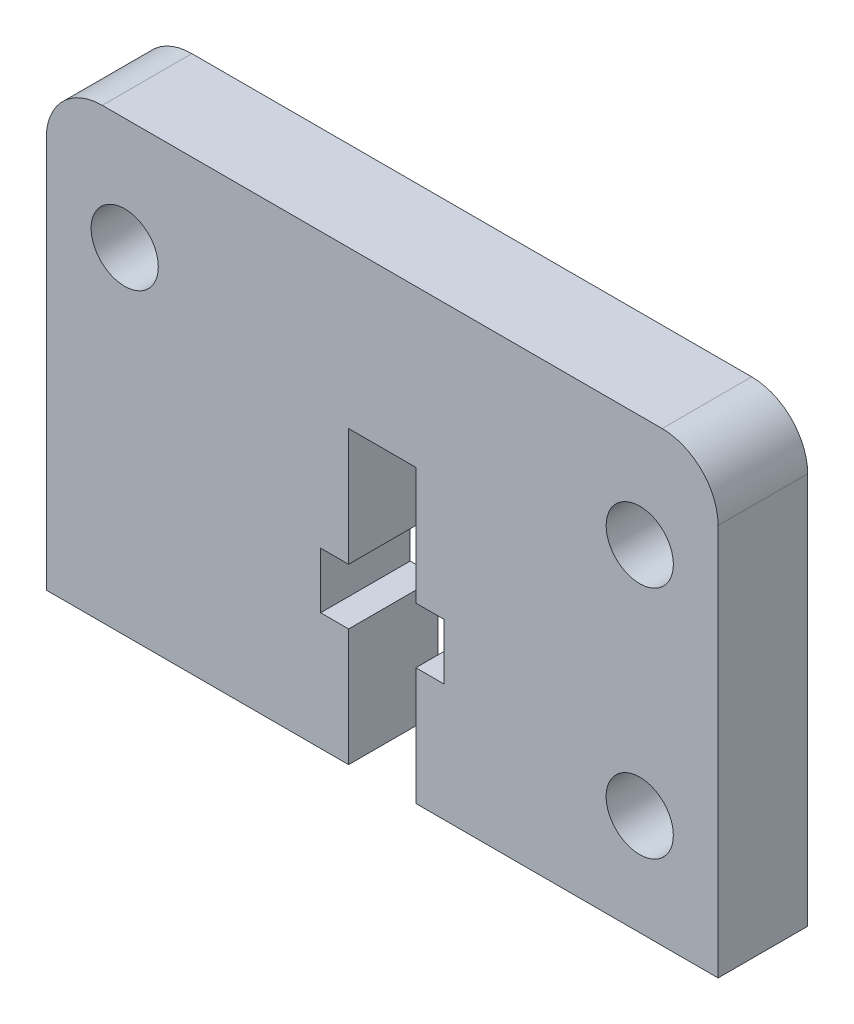
ISO-10303-21;
HEADER;
FILE_DESCRIPTION(('STEP AP214'),'2;1');
FILE_NAME('part.step','',(''),(''),'','','');
FILE_SCHEMA(('AUTOMOTIVE_DESIGN { 1 0 10303 214 1 1 1 1 }'));
ENDSEC;
DATA;
#1=APPLICATION_CONTEXT('core data for automotive mechanical design processes');
#2=APPLICATION_PROTOCOL_DEFINITION('international standard','automotive_design',2000,#1);
#3=PRODUCT_CONTEXT('',#1,'mechanical');
#4=PRODUCT('Part','Part','',(#3));
#5=PRODUCT_RELATED_PRODUCT_CATEGORY('part','',(#4));
#6=PRODUCT_DEFINITION_FORMATION('','',#4);
#7=PRODUCT_DEFINITION_CONTEXT('part definition',#1,'design');
#8=PRODUCT_DEFINITION('design','',#6,#7);
#9=PRODUCT_DEFINITION_SHAPE('','',#8);
#10=(LENGTH_UNIT() NAMED_UNIT(*) SI_UNIT(.MILLI.,.METRE.));
#11=(NAMED_UNIT(*) PLANE_ANGLE_UNIT() SI_UNIT($,.RADIAN.));
#12=(NAMED_UNIT(*) SI_UNIT($,.STERADIAN.) SOLID_ANGLE_UNIT());
#13=UNCERTAINTY_MEASURE_WITH_UNIT(LENGTH_MEASURE(1.E-05),#10,'distance_accuracy_value','');
#14=(GEOMETRIC_REPRESENTATION_CONTEXT(3) GLOBAL_UNCERTAINTY_ASSIGNED_CONTEXT((#13)) GLOBAL_UNIT_ASSIGNED_CONTEXT((#10,
#11,#12)) REPRESENTATION_CONTEXT('',''));
#15=CARTESIAN_POINT('',(0.,0.,0.));
#16=DIRECTION('',(0.,0.,1.));
#17=DIRECTION('',(1.,0.,0.));
#18=AXIS2_PLACEMENT_3D('',#15,#16,#17);
#19=CARTESIAN_POINT('',(0.,0.,4.));
#20=DIRECTION('',(0.,1.,0.));
#21=DIRECTION('',(0.,0.,1.));
#22=AXIS2_PLACEMENT_3D('',#19,#20,#21);
#23=PLANE('',#22);
#24=DIRECTION('',(0.,0.,-1.));
#25=VECTOR('',#24,1.);
#26=CARTESIAN_POINT('',(13.5,0.,49.3458928680426));
#27=LINE('',#26,#25);
#28=CARTESIAN_POINT('',(13.5,0.,4.));
#29=VERTEX_POINT('',#28);
#30=CARTESIAN_POINT('',(13.5,0.,0.));
#31=VERTEX_POINT('',#30);
#32=EDGE_CURVE('E188',#29,#31,#27,.T.);
#33=ORIENTED_EDGE('',*,*,#32,.F.);
#34=DIRECTION('',(1.,0.,0.));
#35=VECTOR('',#34,1.);
#36=CARTESIAN_POINT('',(0.,0.,4.));
#37=LINE('',#36,#35);
#38=CARTESIAN_POINT('',(0.,0.,4.));
#39=VERTEX_POINT('',#38);
#40=EDGE_CURVE('E241',#39,#29,#37,.T.);
#41=ORIENTED_EDGE('',*,*,#40,.F.);
#42=DIRECTION('',(0.,0.,-1.));
#43=VECTOR('',#42,1.);
#44=CARTESIAN_POINT('',(0.,0.,4.));
#45=LINE('',#44,#43);
#46=CARTESIAN_POINT('',(0.,0.,0.));
#47=VERTEX_POINT('',#46);
#48=EDGE_CURVE('E11',#39,#47,#45,.T.);
#49=ORIENTED_EDGE('',*,*,#48,.T.);
#50=DIRECTION('',(1.,0.,0.));
#51=VECTOR('',#50,1.);
#52=CARTESIAN_POINT('',(0.,0.,0.));
#53=LINE('',#52,#51);
#54=EDGE_CURVE('E256',#47,#31,#53,.T.);
#55=ORIENTED_EDGE('',*,*,#54,.T.);
#56=EDGE_LOOP('',(#33,#41,#49,#55));
#57=FACE_BOUND('',#56,.T.);
#58=ADVANCED_FACE('F36',(#57),#23,.F.);
#59=CARTESIAN_POINT('',(2.5,17.5,4.));
#60=DIRECTION('',(0.,0.,1.));
#61=DIRECTION('',(1.,0.,0.));
#62=AXIS2_PLACEMENT_3D('',#59,#60,#61);
#63=PLANE('',#62);
#64=DIRECTION('',(0.,1.,0.));
#65=VECTOR('',#64,1.);
#66=CARTESIAN_POINT('',(16.5,0.,4.));
#67=LINE('',#66,#65);
#68=CARTESIAN_POINT('',(16.5,0.,4.));
#69=VERTEX_POINT('',#68);
#70=CARTESIAN_POINT('',(16.5,5.25,4.));
#71=VERTEX_POINT('',#70);
#72=EDGE_CURVE('E214',#69,#71,#67,.T.);
#73=ORIENTED_EDGE('',*,*,#72,.F.);
#74=CARTESIAN_POINT('',(30.,0.,4.));
#75=VERTEX_POINT('',#74);
#76=EDGE_CURVE('E239',#69,#75,#37,.T.);
#77=ORIENTED_EDGE('',*,*,#76,.T.);
#78=DIRECTION('',(0.,1.,0.));
#79=VECTOR('',#78,1.);
#80=CARTESIAN_POINT('',(30.,0.,4.));
#81=LINE('',#80,#79);
#82=CARTESIAN_POINT('',(30.,17.5,4.));
#83=VERTEX_POINT('',#82);
#84=EDGE_CURVE('E244',#75,#83,#81,.T.);
#85=ORIENTED_EDGE('',*,*,#84,.T.);
#86=CARTESIAN_POINT('',(27.5,17.5,4.));
#87=DIRECTION('',(0.,0.,1.));
#88=DIRECTION('',(-1.,0.,0.));
#89=AXIS2_PLACEMENT_3D('',#86,#87,#88);
#90=CIRCLE('',#89,2.5);
#91=CARTESIAN_POINT('',(27.5,20.,4.));
#92=VERTEX_POINT('',#91);
#93=EDGE_CURVE('E246',#83,#92,#90,.T.);
#94=ORIENTED_EDGE('',*,*,#93,.T.);
#95=DIRECTION('',(-1.,0.,0.));
#96=VECTOR('',#95,1.);
#97=CARTESIAN_POINT('',(2.50000000000002,20.,4.));
#98=LINE('',#97,#96);
#99=CARTESIAN_POINT('',(2.50000000000002,20.,4.));
#100=VERTEX_POINT('',#99);
#101=EDGE_CURVE('E248',#92,#100,#98,.T.);
#102=ORIENTED_EDGE('',*,*,#101,.T.);
#103=CARTESIAN_POINT('',(2.5,17.5,4.));
#104=DIRECTION('',(0.,0.,1.));
#105=DIRECTION('',(1.,0.,0.));
#106=AXIS2_PLACEMENT_3D('',#103,#104,#105);
#107=CIRCLE('',#106,2.5);
#108=CARTESIAN_POINT('',(0.,17.5,4.));
#109=VERTEX_POINT('',#108);
#110=EDGE_CURVE('E250',#100,#109,#107,.T.);
#111=ORIENTED_EDGE('',*,*,#110,.T.);
#112=DIRECTION('',(0.,-1.,0.));
#113=VECTOR('',#112,1.);
#114=CARTESIAN_POINT('',(0.,0.,4.));
#115=LINE('',#114,#113);
#116=EDGE_CURVE('E236',#109,#39,#115,.T.);
#117=ORIENTED_EDGE('',*,*,#116,.T.);
#118=ORIENTED_EDGE('',*,*,#40,.T.);
#119=DIRECTION('',(0.,-1.,0.));
#120=VECTOR('',#119,1.);
#121=CARTESIAN_POINT('',(13.5,0.,4.));
#122=LINE('',#121,#120);
#123=CARTESIAN_POINT('',(13.5,5.25,4.));
#124=VERTEX_POINT('',#123);
#125=EDGE_CURVE('E223',#124,#29,#122,.T.);
#126=ORIENTED_EDGE('',*,*,#125,.F.);
#127=DIRECTION('',(1.,0.,0.));
#128=VECTOR('',#127,1.);
#129=CARTESIAN_POINT('',(13.5,5.25,4.));
#130=LINE('',#129,#128);
#131=CARTESIAN_POINT('',(12.25,5.25,4.));
#132=VERTEX_POINT('',#131);
#133=EDGE_CURVE('E328',#132,#124,#130,.T.);
#134=ORIENTED_EDGE('',*,*,#133,.F.);
#135=DIRECTION('',(0.,-1.,0.));
#136=VECTOR('',#135,1.);
#137=CARTESIAN_POINT('',(12.25,5.25,4.));
#138=LINE('',#137,#136);
#139=CARTESIAN_POINT('',(12.25,7.75,4.));
#140=VERTEX_POINT('',#139);
#141=EDGE_CURVE('E183',#140,#132,#138,.T.);
#142=ORIENTED_EDGE('',*,*,#141,.F.);
#143=DIRECTION('',(-1.,0.,0.));
#144=VECTOR('',#143,1.);
#145=CARTESIAN_POINT('',(12.25,7.75,4.));
#146=LINE('',#145,#144);
#147=CARTESIAN_POINT('',(13.5,7.75,4.));
#148=VERTEX_POINT('',#147);
#149=EDGE_CURVE('E331',#148,#140,#146,.T.);
#150=ORIENTED_EDGE('',*,*,#149,.F.);
#151=DIRECTION('',(0.,-1.,0.));
#152=VECTOR('',#151,1.);
#153=CARTESIAN_POINT('',(13.5,7.75,4.));
#154=LINE('',#153,#152);
#155=CARTESIAN_POINT('',(13.5,13.,4.));
#156=VERTEX_POINT('',#155);
#157=EDGE_CURVE('E334',#156,#148,#154,.T.);
#158=ORIENTED_EDGE('',*,*,#157,.F.);
#159=DIRECTION('',(-1.,0.,0.));
#160=VECTOR('',#159,1.);
#161=CARTESIAN_POINT('',(13.5,13.,4.));
#162=LINE('',#161,#160);
#163=CARTESIAN_POINT('',(16.5,13.,4.));
#164=VERTEX_POINT('',#163);
#165=EDGE_CURVE('E337',#164,#156,#162,.T.);
#166=ORIENTED_EDGE('',*,*,#165,.F.);
#167=DIRECTION('',(0.,1.,0.));
#168=VECTOR('',#167,1.);
#169=CARTESIAN_POINT('',(16.5,7.75,4.));
#170=LINE('',#169,#168);
#171=CARTESIAN_POINT('',(16.5,7.75,4.));
#172=VERTEX_POINT('',#171);
#173=EDGE_CURVE('E340',#172,#164,#170,.T.);
#174=ORIENTED_EDGE('',*,*,#173,.F.);
#175=DIRECTION('',(-1.,0.,0.));
#176=VECTOR('',#175,1.);
#177=CARTESIAN_POINT('',(17.75,7.75,4.));
#178=LINE('',#177,#176);
#179=CARTESIAN_POINT('',(17.75,7.75,4.));
#180=VERTEX_POINT('',#179);
#181=EDGE_CURVE('E343',#180,#172,#178,.T.);
#182=ORIENTED_EDGE('',*,*,#181,.F.);
#183=DIRECTION('',(0.,1.,0.));
#184=VECTOR('',#183,1.);
#185=CARTESIAN_POINT('',(17.75,5.25,4.));
#186=LINE('',#185,#184);
#187=CARTESIAN_POINT('',(17.75,5.25,4.));
#188=VERTEX_POINT('',#187);
#189=EDGE_CURVE('E56',#188,#180,#186,.T.);
#190=ORIENTED_EDGE('',*,*,#189,.F.);
#191=DIRECTION('',(1.,0.,0.));
#192=VECTOR('',#191,1.);
#193=CARTESIAN_POINT('',(16.5,5.25,4.));
#194=LINE('',#193,#192);
#195=EDGE_CURVE('E51',#71,#188,#194,.T.);
#196=ORIENTED_EDGE('',*,*,#195,.F.);
#197=EDGE_LOOP('',(#73,#77,#85,#94,#102,#111,#117,#118,#126,#134,#142,#150,#158,#166,#174,#182,
#190,#196));
#198=FACE_BOUND('',#197,.T.);
#199=CARTESIAN_POINT('',(26.5,15.,4.));
#200=DIRECTION('',(0.,0.,1.));
#201=DIRECTION('',(-1.,0.,0.));
#202=AXIS2_PLACEMENT_3D('',#199,#200,#201);
#203=CIRCLE('',#202,1.5);
#204=CARTESIAN_POINT('',(25.,15.,4.));
#205=VERTEX_POINT('',#204);
#206=EDGE_CURVE('E224',#205,#205,#203,.T.);
#207=ORIENTED_EDGE('',*,*,#206,.F.);
#208=EDGE_LOOP('',(#207));
#209=FACE_BOUND('',#208,.T.);
#210=CARTESIAN_POINT('',(3.5,15.,4.));
#211=DIRECTION('',(0.,0.,1.));
#212=DIRECTION('',(1.,0.,0.));
#213=AXIS2_PLACEMENT_3D('',#210,#211,#212);
#214=CIRCLE('',#213,1.5);
#215=CARTESIAN_POINT('',(5.,15.,4.));
#216=VERTEX_POINT('',#215);
#217=EDGE_CURVE('E230',#216,#216,#214,.T.);
#218=ORIENTED_EDGE('',*,*,#217,.F.);
#219=EDGE_LOOP('',(#218));
#220=FACE_BOUND('',#219,.T.);
#221=CARTESIAN_POINT('',(26.5,4.52,4.));
#222=DIRECTION('',(0.,0.,1.));
#223=DIRECTION('',(1.,0.,0.));
#224=AXIS2_PLACEMENT_3D('',#221,#222,#223);
#225=CIRCLE('',#224,1.5);
#226=CARTESIAN_POINT('',(28.,4.52,4.));
#227=VERTEX_POINT('',#226);
#228=EDGE_CURVE('E216',#227,#227,#225,.T.);
#229=ORIENTED_EDGE('',*,*,#228,.F.);
#230=EDGE_LOOP('',(#229));
#231=FACE_BOUND('',#230,.T.);
#232=ADVANCED_FACE('F299',(#198,#209,#220,#231),#63,.T.);
#233=CARTESIAN_POINT('',(2.5,17.5,0.));
#234=DIRECTION('',(0.,0.,1.));
#235=DIRECTION('',(1.,0.,0.));
#236=AXIS2_PLACEMENT_3D('',#233,#234,#235);
#237=PLANE('',#236);
#238=DIRECTION('',(1.,0.,0.));
#239=VECTOR('',#238,1.);
#240=CARTESIAN_POINT('',(13.5,5.25,0.));
#241=LINE('',#240,#239);
#242=CARTESIAN_POINT('',(12.25,5.25,0.));
#243=VERTEX_POINT('',#242);
#244=CARTESIAN_POINT('',(13.5,5.25,0.));
#245=VERTEX_POINT('',#244);
#246=EDGE_CURVE('E162',#243,#245,#241,.T.);
#247=ORIENTED_EDGE('',*,*,#246,.T.);
#248=DIRECTION('',(0.,-1.,0.));
#249=VECTOR('',#248,1.);
#250=CARTESIAN_POINT('',(13.5,0.,0.));
#251=LINE('',#250,#249);
#252=EDGE_CURVE('E179',#245,#31,#251,.T.);
#253=ORIENTED_EDGE('',*,*,#252,.T.);
#254=ORIENTED_EDGE('',*,*,#54,.F.);
#255=DIRECTION('',(0.,-1.,0.));
#256=VECTOR('',#255,1.);
#257=CARTESIAN_POINT('',(0.,0.,0.));
#258=LINE('',#257,#256);
#259=CARTESIAN_POINT('',(0.,17.5,0.));
#260=VERTEX_POINT('',#259);
#261=EDGE_CURVE('E233',#260,#47,#258,.T.);
#262=ORIENTED_EDGE('',*,*,#261,.F.);
#263=CARTESIAN_POINT('',(2.5,17.5,0.));
#264=DIRECTION('',(0.,0.,1.));
#265=DIRECTION('',(1.,0.,0.));
#266=AXIS2_PLACEMENT_3D('',#263,#264,#265);
#267=CIRCLE('',#266,2.5);
#268=CARTESIAN_POINT('',(2.50000000000002,20.,0.));
#269=VERTEX_POINT('',#268);
#270=EDGE_CURVE('E240',#269,#260,#267,.T.);
#271=ORIENTED_EDGE('',*,*,#270,.F.);
#272=DIRECTION('',(-1.,0.,0.));
#273=VECTOR('',#272,1.);
#274=CARTESIAN_POINT('',(2.50000000000002,20.,0.));
#275=LINE('',#274,#273);
#276=CARTESIAN_POINT('',(27.5,20.,0.));
#277=VERTEX_POINT('',#276);
#278=EDGE_CURVE('E263',#277,#269,#275,.T.);
#279=ORIENTED_EDGE('',*,*,#278,.F.);
#280=CARTESIAN_POINT('',(27.5,17.5,0.));
#281=DIRECTION('',(0.,0.,1.));
#282=DIRECTION('',(-1.,0.,0.));
#283=AXIS2_PLACEMENT_3D('',#280,#281,#282);
#284=CIRCLE('',#283,2.5);
#285=CARTESIAN_POINT('',(30.,17.5,0.));
#286=VERTEX_POINT('',#285);
#287=EDGE_CURVE('E261',#286,#277,#284,.T.);
#288=ORIENTED_EDGE('',*,*,#287,.F.);
#289=DIRECTION('',(0.,1.,0.));
#290=VECTOR('',#289,1.);
#291=CARTESIAN_POINT('',(30.,0.,0.));
#292=LINE('',#291,#290);
#293=CARTESIAN_POINT('',(30.,0.,0.));
#294=VERTEX_POINT('',#293);
#295=EDGE_CURVE('E259',#294,#286,#292,.T.);
#296=ORIENTED_EDGE('',*,*,#295,.F.);
#297=CARTESIAN_POINT('',(16.5,0.,0.));
#298=VERTEX_POINT('',#297);
#299=EDGE_CURVE('E255',#298,#294,#53,.T.);
#300=ORIENTED_EDGE('',*,*,#299,.F.);
#301=DIRECTION('',(0.,1.,0.));
#302=VECTOR('',#301,1.);
#303=CARTESIAN_POINT('',(16.5,0.,0.));
#304=LINE('',#303,#302);
#305=CARTESIAN_POINT('',(16.5,5.25,0.));
#306=VERTEX_POINT('',#305);
#307=EDGE_CURVE('E307',#298,#306,#304,.T.);
#308=ORIENTED_EDGE('',*,*,#307,.T.);
#309=DIRECTION('',(1.,0.,0.));
#310=VECTOR('',#309,1.);
#311=CARTESIAN_POINT('',(16.5,5.25,0.));
#312=LINE('',#311,#310);
#313=CARTESIAN_POINT('',(17.75,5.25,0.));
#314=VERTEX_POINT('',#313);
#315=EDGE_CURVE('E309',#306,#314,#312,.T.);
#316=ORIENTED_EDGE('',*,*,#315,.T.);
#317=DIRECTION('',(0.,1.,0.));
#318=VECTOR('',#317,1.);
#319=CARTESIAN_POINT('',(17.75,5.25,0.));
#320=LINE('',#319,#318);
#321=CARTESIAN_POINT('',(17.75,7.75,0.));
#322=VERTEX_POINT('',#321);
#323=EDGE_CURVE('E312',#314,#322,#320,.T.);
#324=ORIENTED_EDGE('',*,*,#323,.T.);
#325=DIRECTION('',(-1.,0.,0.));
#326=VECTOR('',#325,1.);
#327=CARTESIAN_POINT('',(17.75,7.75,0.));
#328=LINE('',#327,#326);
#329=CARTESIAN_POINT('',(16.5,7.75,0.));
#330=VERTEX_POINT('',#329);
#331=EDGE_CURVE('E316',#322,#330,#328,.T.);
#332=ORIENTED_EDGE('',*,*,#331,.T.);
#333=DIRECTION('',(0.,1.,0.));
#334=VECTOR('',#333,1.);
#335=CARTESIAN_POINT('',(16.5,7.75,0.));
#336=LINE('',#335,#334);
#337=CARTESIAN_POINT('',(16.5,13.,0.));
#338=VERTEX_POINT('',#337);
#339=EDGE_CURVE('E318',#330,#338,#336,.T.);
#340=ORIENTED_EDGE('',*,*,#339,.T.);
#341=DIRECTION('',(-1.,0.,0.));
#342=VECTOR('',#341,1.);
#343=CARTESIAN_POINT('',(13.5,13.,0.));
#344=LINE('',#343,#342);
#345=CARTESIAN_POINT('',(13.5,13.,0.));
#346=VERTEX_POINT('',#345);
#347=EDGE_CURVE('E320',#338,#346,#344,.T.);
#348=ORIENTED_EDGE('',*,*,#347,.T.);
#349=DIRECTION('',(0.,-1.,0.));
#350=VECTOR('',#349,1.);
#351=CARTESIAN_POINT('',(13.5,7.75,0.));
#352=LINE('',#351,#350);
#353=CARTESIAN_POINT('',(13.5,7.75,0.));
#354=VERTEX_POINT('',#353);
#355=EDGE_CURVE('E322',#346,#354,#352,.T.);
#356=ORIENTED_EDGE('',*,*,#355,.T.);
#357=DIRECTION('',(-1.,0.,0.));
#358=VECTOR('',#357,1.);
#359=CARTESIAN_POINT('',(12.25,7.75,0.));
#360=LINE('',#359,#358);
#361=CARTESIAN_POINT('',(12.25,7.75,0.));
#362=VERTEX_POINT('',#361);
#363=EDGE_CURVE('E165',#354,#362,#360,.T.);
#364=ORIENTED_EDGE('',*,*,#363,.T.);
#365=DIRECTION('',(0.,-1.,0.));
#366=VECTOR('',#365,1.);
#367=CARTESIAN_POINT('',(12.25,5.25,0.));
#368=LINE('',#367,#366);
#369=EDGE_CURVE('E158',#362,#243,#368,.T.);
#370=ORIENTED_EDGE('',*,*,#369,.T.);
#371=EDGE_LOOP('',(#247,#253,#254,#262,#271,#279,#288,#296,#300,#308,#316,#324,#332,#340,#348,
#356,#364,#370));
#372=FACE_BOUND('',#371,.T.);
#373=CARTESIAN_POINT('',(3.5,15.,0.));
#374=DIRECTION('',(0.,0.,1.));
#375=DIRECTION('',(1.,0.,0.));
#376=AXIS2_PLACEMENT_3D('',#373,#374,#375);
#377=CIRCLE('',#376,1.5);
#378=CARTESIAN_POINT('',(5.,15.,0.));
#379=VERTEX_POINT('',#378);
#380=EDGE_CURVE('E227',#379,#379,#377,.T.);
#381=ORIENTED_EDGE('',*,*,#380,.T.);
#382=EDGE_LOOP('',(#381));
#383=FACE_BOUND('',#382,.T.);
#384=CARTESIAN_POINT('',(26.5,15.,0.));
#385=DIRECTION('',(0.,0.,1.));
#386=DIRECTION('',(-1.,0.,0.));
#387=AXIS2_PLACEMENT_3D('',#384,#385,#386);
#388=CIRCLE('',#387,1.5);
#389=CARTESIAN_POINT('',(25.,15.,0.));
#390=VERTEX_POINT('',#389);
#391=EDGE_CURVE('E219',#390,#390,#388,.T.);
#392=ORIENTED_EDGE('',*,*,#391,.T.);
#393=EDGE_LOOP('',(#392));
#394=FACE_BOUND('',#393,.T.);
#395=CARTESIAN_POINT('',(26.5,4.52,0.));
#396=DIRECTION('',(0.,0.,1.));
#397=DIRECTION('',(1.,0.,0.));
#398=AXIS2_PLACEMENT_3D('',#395,#396,#397);
#399=CIRCLE('',#398,1.5);
#400=CARTESIAN_POINT('',(28.,4.52,0.));
#401=VERTEX_POINT('',#400);
#402=EDGE_CURVE('E220',#401,#401,#399,.T.);
#403=ORIENTED_EDGE('',*,*,#402,.T.);
#404=EDGE_LOOP('',(#403));
#405=FACE_BOUND('',#404,.T.);
#406=ADVANCED_FACE('F160',(#372,#383,#394,#405),#237,.F.);
#407=CARTESIAN_POINT('',(0.,0.,4.));
#408=DIRECTION('',(1.,0.,0.));
#409=DIRECTION('',(0.,0.,-1.));
#410=AXIS2_PLACEMENT_3D('',#407,#408,#409);
#411=PLANE('',#410);
#412=ORIENTED_EDGE('',*,*,#261,.T.);
#413=ORIENTED_EDGE('',*,*,#48,.F.);
#414=ORIENTED_EDGE('',*,*,#116,.F.);
#415=DIRECTION('',(0.,0.,-1.));
#416=VECTOR('',#415,1.);
#417=CARTESIAN_POINT('',(0.,17.5,4.));
#418=LINE('',#417,#416);
#419=EDGE_CURVE('E252',#109,#260,#418,.T.);
#420=ORIENTED_EDGE('',*,*,#419,.T.);
#421=EDGE_LOOP('',(#412,#413,#414,#420));
#422=FACE_BOUND('',#421,.T.);
#423=ADVANCED_FACE('F38',(#422),#411,.F.);
#424=ORIENTED_EDGE('',*,*,#76,.F.);
#425=DIRECTION('',(0.,0.,-1.));
#426=VECTOR('',#425,1.);
#427=CARTESIAN_POINT('',(16.5,0.,49.3458928680426));
#428=LINE('',#427,#426);
#429=EDGE_CURVE('E212',#69,#298,#428,.T.);
#430=ORIENTED_EDGE('',*,*,#429,.T.);
#431=ORIENTED_EDGE('',*,*,#299,.T.);
#432=DIRECTION('',(0.,0.,-1.));
#433=VECTOR('',#432,1.);
#434=CARTESIAN_POINT('',(30.,0.,4.));
#435=LINE('',#434,#433);
#436=EDGE_CURVE('E44',#75,#294,#435,.T.);
#437=ORIENTED_EDGE('',*,*,#436,.F.);
#438=EDGE_LOOP('',(#424,#430,#431,#437));
#439=FACE_BOUND('',#438,.T.);
#440=ADVANCED_FACE('F303',(#439),#23,.F.);
#441=CARTESIAN_POINT('',(30.,0.,4.));
#442=DIRECTION('',(-1.,0.,0.));
#443=DIRECTION('',(0.,0.,1.));
#444=AXIS2_PLACEMENT_3D('',#441,#442,#443);
#445=PLANE('',#444);
#446=ORIENTED_EDGE('',*,*,#295,.T.);
#447=DIRECTION('',(0.,0.,-1.));
#448=VECTOR('',#447,1.);
#449=CARTESIAN_POINT('',(30.,17.5,4.));
#450=LINE('',#449,#448);
#451=EDGE_CURVE('E274',#83,#286,#450,.T.);
#452=ORIENTED_EDGE('',*,*,#451,.F.);
#453=ORIENTED_EDGE('',*,*,#84,.F.);
#454=ORIENTED_EDGE('',*,*,#436,.T.);
#455=EDGE_LOOP('',(#446,#452,#453,#454));
#456=FACE_BOUND('',#455,.T.);
#457=ADVANCED_FACE('F281',(#456),#445,.F.);
#458=CARTESIAN_POINT('',(27.5,17.5,4.));
#459=DIRECTION('',(0.,0.,-1.));
#460=DIRECTION('',(-1.,0.,0.));
#461=AXIS2_PLACEMENT_3D('',#458,#459,#460);
#462=CYLINDRICAL_SURFACE('',#461,2.5);
#463=ORIENTED_EDGE('',*,*,#287,.T.);
#464=DIRECTION('',(0.,0.,-1.));
#465=VECTOR('',#464,1.);
#466=CARTESIAN_POINT('',(27.5,20.,4.));
#467=LINE('',#466,#465);
#468=EDGE_CURVE('E271',#92,#277,#467,.T.);
#469=ORIENTED_EDGE('',*,*,#468,.F.);
#470=ORIENTED_EDGE('',*,*,#93,.F.);
#471=ORIENTED_EDGE('',*,*,#451,.T.);
#472=EDGE_LOOP('',(#463,#469,#470,#471));
#473=FACE_BOUND('',#472,.T.);
#474=ADVANCED_FACE('F292',(#473),#462,.T.);
#475=CARTESIAN_POINT('',(2.50000000000002,20.,4.));
#476=DIRECTION('',(0.,-1.,0.));
#477=DIRECTION('',(0.,0.,-1.));
#478=AXIS2_PLACEMENT_3D('',#475,#476,#477);
#479=PLANE('',#478);
#480=ORIENTED_EDGE('',*,*,#278,.T.);
#481=DIRECTION('',(0.,0.,-1.));
#482=VECTOR('',#481,1.);
#483=CARTESIAN_POINT('',(2.50000000000002,20.,4.));
#484=LINE('',#483,#482);
#485=EDGE_CURVE('E268',#100,#269,#484,.T.);
#486=ORIENTED_EDGE('',*,*,#485,.F.);
#487=ORIENTED_EDGE('',*,*,#101,.F.);
#488=ORIENTED_EDGE('',*,*,#468,.T.);
#489=EDGE_LOOP('',(#480,#486,#487,#488));
#490=FACE_BOUND('',#489,.T.);
#491=ADVANCED_FACE('F296',(#490),#479,.F.);
#492=CARTESIAN_POINT('',(2.5,17.5,4.));
#493=DIRECTION('',(0.,0.,-1.));
#494=DIRECTION('',(-1.,0.,0.));
#495=AXIS2_PLACEMENT_3D('',#492,#493,#494);
#496=CYLINDRICAL_SURFACE('',#495,2.5);
#497=ORIENTED_EDGE('',*,*,#270,.T.);
#498=ORIENTED_EDGE('',*,*,#419,.F.);
#499=ORIENTED_EDGE('',*,*,#110,.F.);
#500=ORIENTED_EDGE('',*,*,#485,.T.);
#501=EDGE_LOOP('',(#497,#498,#499,#500));
#502=FACE_BOUND('',#501,.T.);
#503=ADVANCED_FACE('F380',(#502),#496,.T.);
#504=CARTESIAN_POINT('',(3.5,15.,4.));
#505=DIRECTION('',(0.,0.,-1.));
#506=DIRECTION('',(-1.,0.,0.));
#507=AXIS2_PLACEMENT_3D('',#504,#505,#506);
#508=CYLINDRICAL_SURFACE('',#507,1.5);
#509=ORIENTED_EDGE('',*,*,#217,.T.);
#510=EDGE_LOOP('',(#509));
#511=FACE_BOUND('',#510,.T.);
#512=ORIENTED_EDGE('',*,*,#380,.F.);
#513=EDGE_LOOP('',(#512));
#514=FACE_BOUND('',#513,.T.);
#515=ADVANCED_FACE('F382',(#511,#514),#508,.F.);
#516=CARTESIAN_POINT('',(26.5,15.,4.));
#517=DIRECTION('',(0.,0.,-1.));
#518=DIRECTION('',(-1.,0.,0.));
#519=AXIS2_PLACEMENT_3D('',#516,#517,#518);
#520=CYLINDRICAL_SURFACE('',#519,1.5);
#521=ORIENTED_EDGE('',*,*,#206,.T.);
#522=EDGE_LOOP('',(#521));
#523=FACE_BOUND('',#522,.T.);
#524=ORIENTED_EDGE('',*,*,#391,.F.);
#525=EDGE_LOOP('',(#524));
#526=FACE_BOUND('',#525,.T.);
#527=ADVANCED_FACE('F388',(#523,#526),#520,.F.);
#528=CARTESIAN_POINT('',(26.5,4.52,4.));
#529=DIRECTION('',(0.,0.,-1.));
#530=DIRECTION('',(-1.,0.,0.));
#531=AXIS2_PLACEMENT_3D('',#528,#529,#530);
#532=CYLINDRICAL_SURFACE('',#531,1.5);
#533=ORIENTED_EDGE('',*,*,#228,.T.);
#534=EDGE_LOOP('',(#533));
#535=FACE_BOUND('',#534,.T.);
#536=ORIENTED_EDGE('',*,*,#402,.F.);
#537=EDGE_LOOP('',(#536));
#538=FACE_BOUND('',#537,.T.);
#539=ADVANCED_FACE('F412',(#535,#538),#532,.F.);
#540=CARTESIAN_POINT('',(16.5,0.,49.3458928680426));
#541=DIRECTION('',(-1.,0.,0.));
#542=DIRECTION('',(0.,0.,1.));
#543=AXIS2_PLACEMENT_3D('',#540,#541,#542);
#544=PLANE('',#543);
#545=ORIENTED_EDGE('',*,*,#429,.F.);
#546=ORIENTED_EDGE('',*,*,#72,.T.);
#547=DIRECTION('',(0.,0.,-1.));
#548=VECTOR('',#547,1.);
#549=CARTESIAN_POINT('',(16.5,5.25,49.3458928680426));
#550=LINE('',#549,#548);
#551=EDGE_CURVE('E209',#71,#306,#550,.T.);
#552=ORIENTED_EDGE('',*,*,#551,.T.);
#553=ORIENTED_EDGE('',*,*,#307,.F.);
#554=EDGE_LOOP('',(#545,#546,#552,#553));
#555=FACE_BOUND('',#554,.T.);
#556=ADVANCED_FACE('F305',(#555),#544,.T.);
#557=CARTESIAN_POINT('',(16.5,5.25,49.3458928680426));
#558=DIRECTION('',(0.,1.,0.));
#559=DIRECTION('',(-1.,0.,0.));
#560=AXIS2_PLACEMENT_3D('',#557,#558,#559);
#561=PLANE('',#560);
#562=ORIENTED_EDGE('',*,*,#551,.F.);
#563=ORIENTED_EDGE('',*,*,#195,.T.);
#564=DIRECTION('',(0.,0.,-1.));
#565=VECTOR('',#564,1.);
#566=CARTESIAN_POINT('',(17.75,5.25,49.3458928680426));
#567=LINE('',#566,#565);
#568=EDGE_CURVE('E206',#188,#314,#567,.T.);
#569=ORIENTED_EDGE('',*,*,#568,.T.);
#570=ORIENTED_EDGE('',*,*,#315,.F.);
#571=EDGE_LOOP('',(#562,#563,#569,#570));
#572=FACE_BOUND('',#571,.T.);
#573=ADVANCED_FACE('F349',(#572),#561,.T.);
#574=CARTESIAN_POINT('',(17.75,5.25,49.3458928680426));
#575=DIRECTION('',(-1.,0.,0.));
#576=DIRECTION('',(0.,-1.,0.));
#577=AXIS2_PLACEMENT_3D('',#574,#575,#576);
#578=PLANE('',#577);
#579=ORIENTED_EDGE('',*,*,#568,.F.);
#580=ORIENTED_EDGE('',*,*,#189,.T.);
#581=DIRECTION('',(0.,0.,-1.));
#582=VECTOR('',#581,1.);
#583=CARTESIAN_POINT('',(17.75,7.75,49.3458928680426));
#584=LINE('',#583,#582);
#585=EDGE_CURVE('E203',#180,#322,#584,.T.);
#586=ORIENTED_EDGE('',*,*,#585,.T.);
#587=ORIENTED_EDGE('',*,*,#323,.F.);
#588=EDGE_LOOP('',(#579,#580,#586,#587));
#589=FACE_BOUND('',#588,.T.);
#590=ADVANCED_FACE('F352',(#589),#578,.T.);
#591=CARTESIAN_POINT('',(17.75,7.75,49.3458928680426));
#592=DIRECTION('',(0.,-1.,0.));
#593=DIRECTION('',(1.,0.,0.));
#594=AXIS2_PLACEMENT_3D('',#591,#592,#593);
#595=PLANE('',#594);
#596=ORIENTED_EDGE('',*,*,#585,.F.);
#597=ORIENTED_EDGE('',*,*,#181,.T.);
#598=DIRECTION('',(0.,0.,-1.));
#599=VECTOR('',#598,1.);
#600=CARTESIAN_POINT('',(16.5,7.75,49.3458928680426));
#601=LINE('',#600,#599);
#602=EDGE_CURVE('E200',#172,#330,#601,.T.);
#603=ORIENTED_EDGE('',*,*,#602,.T.);
#604=ORIENTED_EDGE('',*,*,#331,.F.);
#605=EDGE_LOOP('',(#596,#597,#603,#604));
#606=FACE_BOUND('',#605,.T.);
#607=ADVANCED_FACE('F357',(#606),#595,.T.);
#608=CARTESIAN_POINT('',(16.5,7.75,49.3458928680426));
#609=DIRECTION('',(-1.,0.,0.));
#610=DIRECTION('',(0.,-1.,0.));
#611=AXIS2_PLACEMENT_3D('',#608,#609,#610);
#612=PLANE('',#611);
#613=ORIENTED_EDGE('',*,*,#602,.F.);
#614=ORIENTED_EDGE('',*,*,#173,.T.);
#615=DIRECTION('',(0.,0.,-1.));
#616=VECTOR('',#615,1.);
#617=CARTESIAN_POINT('',(16.5,13.,49.3458928680426));
#618=LINE('',#617,#616);
#619=EDGE_CURVE('E197',#164,#338,#618,.T.);
#620=ORIENTED_EDGE('',*,*,#619,.T.);
#621=ORIENTED_EDGE('',*,*,#339,.F.);
#622=EDGE_LOOP('',(#613,#614,#620,#621));
#623=FACE_BOUND('',#622,.T.);
#624=ADVANCED_FACE('F360',(#623),#612,.T.);
#625=CARTESIAN_POINT('',(13.5,13.,49.3458928680426));
#626=DIRECTION('',(0.,-1.,0.));
#627=DIRECTION('',(0.,0.,-1.));
#628=AXIS2_PLACEMENT_3D('',#625,#626,#627);
#629=PLANE('',#628);
#630=ORIENTED_EDGE('',*,*,#619,.F.);
#631=ORIENTED_EDGE('',*,*,#165,.T.);
#632=DIRECTION('',(0.,0.,-1.));
#633=VECTOR('',#632,1.);
#634=CARTESIAN_POINT('',(13.5,13.,49.3458928680426));
#635=LINE('',#634,#633);
#636=EDGE_CURVE('E194',#156,#346,#635,.T.);
#637=ORIENTED_EDGE('',*,*,#636,.T.);
#638=ORIENTED_EDGE('',*,*,#347,.F.);
#639=EDGE_LOOP('',(#630,#631,#637,#638));
#640=FACE_BOUND('',#639,.T.);
#641=ADVANCED_FACE('F365',(#640),#629,.T.);
#642=CARTESIAN_POINT('',(13.5,7.75,49.3458928680426));
#643=DIRECTION('',(1.,0.,0.));
#644=DIRECTION('',(0.,1.,0.));
#645=AXIS2_PLACEMENT_3D('',#642,#643,#644);
#646=PLANE('',#645);
#647=ORIENTED_EDGE('',*,*,#636,.F.);
#648=ORIENTED_EDGE('',*,*,#157,.T.);
#649=DIRECTION('',(0.,0.,-1.));
#650=VECTOR('',#649,1.);
#651=CARTESIAN_POINT('',(13.5,7.75,49.3458928680426));
#652=LINE('',#651,#650);
#653=EDGE_CURVE('E186',#148,#354,#652,.T.);
#654=ORIENTED_EDGE('',*,*,#653,.T.);
#655=ORIENTED_EDGE('',*,*,#355,.F.);
#656=EDGE_LOOP('',(#647,#648,#654,#655));
#657=FACE_BOUND('',#656,.T.);
#658=ADVANCED_FACE('F368',(#657),#646,.T.);
#659=CARTESIAN_POINT('',(12.25,7.75,49.3458928680426));
#660=DIRECTION('',(0.,-1.,0.));
#661=DIRECTION('',(1.,0.,0.));
#662=AXIS2_PLACEMENT_3D('',#659,#660,#661);
#663=PLANE('',#662);
#664=ORIENTED_EDGE('',*,*,#653,.F.);
#665=ORIENTED_EDGE('',*,*,#149,.T.);
#666=DIRECTION('',(0.,0.,-1.));
#667=VECTOR('',#666,1.);
#668=CARTESIAN_POINT('',(12.25,7.75,49.3458928680426));
#669=LINE('',#668,#667);
#670=EDGE_CURVE('E184',#140,#362,#669,.T.);
#671=ORIENTED_EDGE('',*,*,#670,.T.);
#672=ORIENTED_EDGE('',*,*,#363,.F.);
#673=EDGE_LOOP('',(#664,#665,#671,#672));
#674=FACE_BOUND('',#673,.T.);
#675=ADVANCED_FACE('F371',(#674),#663,.T.);
#676=CARTESIAN_POINT('',(12.25,5.25,49.3458928680426));
#677=DIRECTION('',(1.,0.,0.));
#678=DIRECTION('',(0.,0.,-1.));
#679=AXIS2_PLACEMENT_3D('',#676,#677,#678);
#680=PLANE('',#679);
#681=ORIENTED_EDGE('',*,*,#670,.F.);
#682=ORIENTED_EDGE('',*,*,#141,.T.);
#683=DIRECTION('',(0.,0.,-1.));
#684=VECTOR('',#683,1.);
#685=CARTESIAN_POINT('',(12.25,5.25,49.3458928680426));
#686=LINE('',#685,#684);
#687=EDGE_CURVE('E176',#132,#243,#686,.T.);
#688=ORIENTED_EDGE('',*,*,#687,.T.);
#689=ORIENTED_EDGE('',*,*,#369,.F.);
#690=EDGE_LOOP('',(#681,#682,#688,#689));
#691=FACE_BOUND('',#690,.T.);
#692=ADVANCED_FACE('F182',(#691),#680,.T.);
#693=CARTESIAN_POINT('',(13.5,5.25,49.3458928680426));
#694=DIRECTION('',(0.,1.,0.));
#695=DIRECTION('',(-1.,0.,0.));
#696=AXIS2_PLACEMENT_3D('',#693,#694,#695);
#697=PLANE('',#696);
#698=ORIENTED_EDGE('',*,*,#687,.F.);
#699=ORIENTED_EDGE('',*,*,#133,.T.);
#700=DIRECTION('',(0.,0.,-1.));
#701=VECTOR('',#700,1.);
#702=CARTESIAN_POINT('',(13.5,5.25,49.3458928680426));
#703=LINE('',#702,#701);
#704=EDGE_CURVE('E178',#124,#245,#703,.T.);
#705=ORIENTED_EDGE('',*,*,#704,.T.);
#706=ORIENTED_EDGE('',*,*,#246,.F.);
#707=EDGE_LOOP('',(#698,#699,#705,#706));
#708=FACE_BOUND('',#707,.T.);
#709=ADVANCED_FACE('F174',(#708),#697,.T.);
#710=CARTESIAN_POINT('',(13.5,0.,49.3458928680426));
#711=DIRECTION('',(1.,0.,0.));
#712=DIRECTION('',(0.,0.,-1.));
#713=AXIS2_PLACEMENT_3D('',#710,#711,#712);
#714=PLANE('',#713);
#715=ORIENTED_EDGE('',*,*,#704,.F.);
#716=ORIENTED_EDGE('',*,*,#125,.T.);
#717=ORIENTED_EDGE('',*,*,#32,.T.);
#718=ORIENTED_EDGE('',*,*,#252,.F.);
#719=EDGE_LOOP('',(#715,#716,#717,#718));
#720=FACE_BOUND('',#719,.T.);
#721=ADVANCED_FACE('F373',(#720),#714,.T.);
#722=CLOSED_SHELL('',(#58,#232,#406,#423,#440,#457,#474,#491,#503,#515,#527,#539,#556,#573,#590,
#607,#624,#641,#658,#675,#692,#709,#721));
#723=MANIFOLD_SOLID_BREP('B2',#722);
#724=ADVANCED_BREP_SHAPE_REPRESENTATION('',(#18,#723),#14);
#725=SHAPE_DEFINITION_REPRESENTATION(#9,#724);
ENDSEC;
END-ISO-10303-21;
